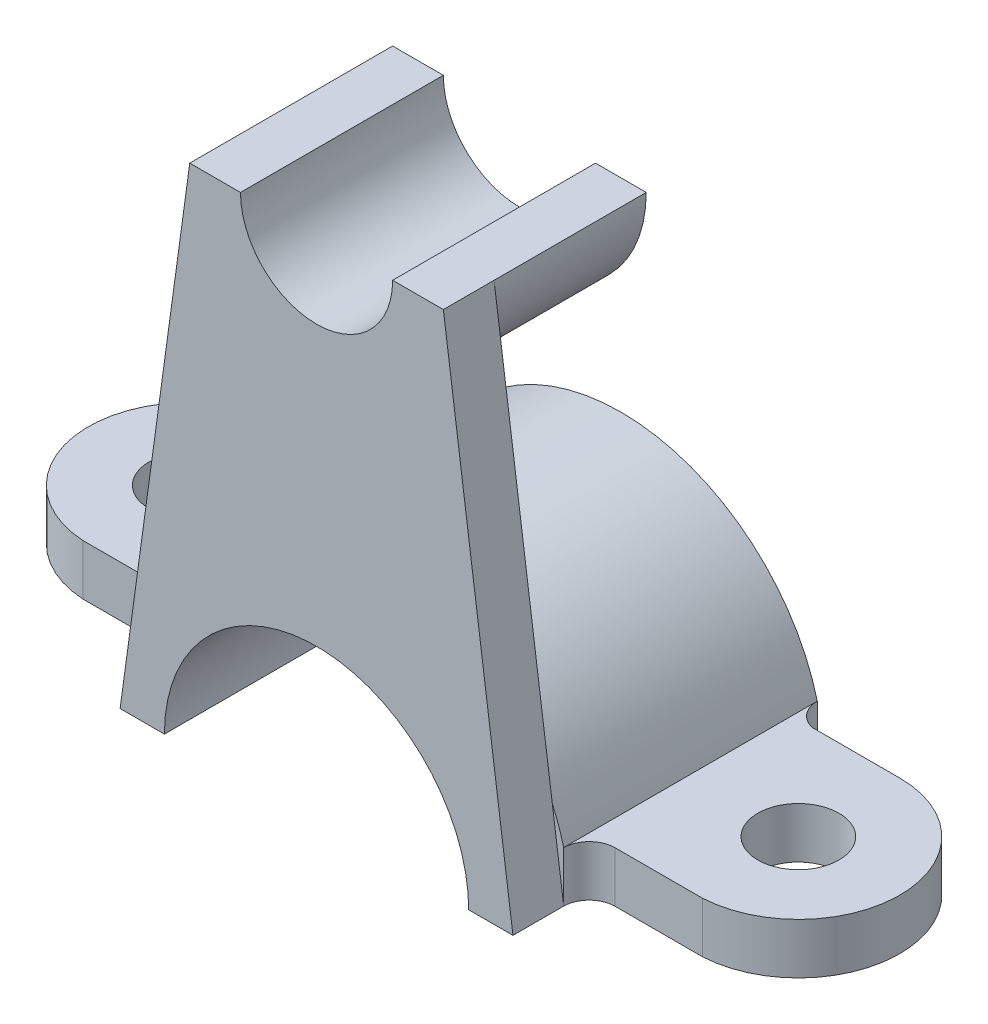
ISO-10303-21;
HEADER;
FILE_DESCRIPTION(('STEP AP214'),'2;1');
FILE_NAME('part.step','',(''),(''),'','','');
FILE_SCHEMA(('AUTOMOTIVE_DESIGN { 1 0 10303 214 1 1 1 1 }'));
ENDSEC;
DATA;
#1=APPLICATION_CONTEXT('core data for automotive mechanical design processes');
#2=APPLICATION_PROTOCOL_DEFINITION('international standard','automotive_design',2000,#1);
#3=PRODUCT_CONTEXT('',#1,'mechanical');
#4=PRODUCT('Part','Part','',(#3));
#5=PRODUCT_RELATED_PRODUCT_CATEGORY('part','',(#4));
#6=PRODUCT_DEFINITION_FORMATION('','',#4);
#7=PRODUCT_DEFINITION_CONTEXT('part definition',#1,'design');
#8=PRODUCT_DEFINITION('design','',#6,#7);
#9=PRODUCT_DEFINITION_SHAPE('','',#8);
#10=(LENGTH_UNIT() NAMED_UNIT(*) SI_UNIT(.MILLI.,.METRE.));
#11=(NAMED_UNIT(*) PLANE_ANGLE_UNIT() SI_UNIT($,.RADIAN.));
#12=(NAMED_UNIT(*) SI_UNIT($,.STERADIAN.) SOLID_ANGLE_UNIT());
#13=UNCERTAINTY_MEASURE_WITH_UNIT(LENGTH_MEASURE(1.E-05),#10,'distance_accuracy_value','');
#14=(GEOMETRIC_REPRESENTATION_CONTEXT(3) GLOBAL_UNCERTAINTY_ASSIGNED_CONTEXT((#13)) GLOBAL_UNIT_ASSIGNED_CONTEXT((#10,
#11,#12)) REPRESENTATION_CONTEXT('',''));
#15=CARTESIAN_POINT('',(0.,0.,0.));
#16=DIRECTION('',(0.,0.,1.));
#17=DIRECTION('',(1.,0.,0.));
#18=AXIS2_PLACEMENT_3D('',#15,#16,#17);
#19=CARTESIAN_POINT('',(-25.,100.,35.));
#20=DIRECTION('',(0.,-1.,0.));
#21=DIRECTION('',(0.,0.,-1.));
#22=AXIS2_PLACEMENT_3D('',#19,#20,#21);
#23=PLANE('',#22);
#24=DIRECTION('',(-1.,0.,0.));
#25=VECTOR('',#24,1.);
#26=CARTESIAN_POINT('',(-25.,100.,35.));
#27=LINE('',#26,#25);
#28=CARTESIAN_POINT('',(-15.,100.,35.));
#29=VERTEX_POINT('',#28);
#30=CARTESIAN_POINT('',(-25.,100.,35.));
#31=VERTEX_POINT('',#30);
#32=EDGE_CURVE('E188',#29,#31,#27,.T.);
#33=ORIENTED_EDGE('',*,*,#32,.F.);
#34=DIRECTION('',(0.,0.,-1.));
#35=VECTOR('',#34,1.);
#36=CARTESIAN_POINT('',(-15.,100.,35.));
#37=LINE('',#36,#35);
#38=CARTESIAN_POINT('',(-15.,100.,-5.));
#39=VERTEX_POINT('',#38);
#40=EDGE_CURVE('E175',#29,#39,#37,.T.);
#41=ORIENTED_EDGE('',*,*,#40,.T.);
#42=DIRECTION('',(1.,0.,0.));
#43=VECTOR('',#42,1.);
#44=CARTESIAN_POINT('',(25.,100.,-5.));
#45=LINE('',#44,#43);
#46=CARTESIAN_POINT('',(-25.,100.,-5.));
#47=VERTEX_POINT('',#46);
#48=EDGE_CURVE('E428',#47,#39,#45,.T.);
#49=ORIENTED_EDGE('',*,*,#48,.F.);
#50=DIRECTION('',(0.,0.,1.));
#51=VECTOR('',#50,1.);
#52=CARTESIAN_POINT('',(-25.,100.,-5.));
#53=LINE('',#52,#51);
#54=CARTESIAN_POINT('',(-25.,100.,25.));
#55=VERTEX_POINT('',#54);
#56=EDGE_CURVE('E357',#47,#55,#53,.T.);
#57=ORIENTED_EDGE('',*,*,#56,.T.);
#58=DIRECTION('',(0.,0.,-1.));
#59=VECTOR('',#58,1.);
#60=CARTESIAN_POINT('',(-25.,100.,35.));
#61=LINE('',#60,#59);
#62=EDGE_CURVE('E195',#31,#55,#61,.T.);
#63=ORIENTED_EDGE('',*,*,#62,.F.);
#64=EDGE_LOOP('',(#33,#41,#49,#57,#63));
#65=FACE_BOUND('',#64,.T.);
#66=ADVANCED_FACE('F32',(#65),#23,.F.);
#67=CARTESIAN_POINT('',(0.,0.,25.));
#68=DIRECTION('',(0.,0.,-1.));
#69=DIRECTION('',(-1.,0.,0.));
#70=AXIS2_PLACEMENT_3D('',#67,#68,#69);
#71=PLANE('',#70);
#72=DIRECTION('',(-0.136022253963476,-0.990705781968944,0.));
#73=VECTOR('',#72,1.);
#74=CARTESIAN_POINT('',(-38.7298334620742,0.,25.));
#75=LINE('',#74,#73);
#76=CARTESIAN_POINT('',(-36.4758209248233,16.4168964137629,25.));
#77=VERTEX_POINT('',#76);
#78=EDGE_CURVE('E43',#55,#77,#75,.T.);
#79=ORIENTED_EDGE('',*,*,#78,.F.);
#80=CARTESIAN_POINT('',(0.,100.,25.));
#81=DIRECTION('',(0.,0.,-1.));
#82=DIRECTION('',(-1.,0.,0.));
#83=AXIS2_PLACEMENT_3D('',#80,#81,#82);
#84=CIRCLE('',#83,25.);
#85=CARTESIAN_POINT('',(25.,100.,25.));
#86=VERTEX_POINT('',#85);
#87=EDGE_CURVE('E420',#86,#55,#84,.T.);
#88=ORIENTED_EDGE('',*,*,#87,.F.);
#89=DIRECTION('',(-0.136022253963476,0.990705781968944,0.));
#90=VECTOR('',#89,1.);
#91=CARTESIAN_POINT('',(38.7298334620742,0.,25.));
#92=LINE('',#91,#90);
#93=CARTESIAN_POINT('',(36.4758209248233,16.4168964137629,25.));
#94=VERTEX_POINT('',#93);
#95=EDGE_CURVE('E204',#94,#86,#92,.T.);
#96=ORIENTED_EDGE('',*,*,#95,.F.);
#97=CARTESIAN_POINT('',(0.,0.,25.));
#98=DIRECTION('',(0.,0.,1.));
#99=DIRECTION('',(1.,0.,0.));
#100=AXIS2_PLACEMENT_3D('',#97,#98,#99);
#101=CIRCLE('',#100,40.);
#102=EDGE_CURVE('E318',#94,#77,#101,.T.);
#103=ORIENTED_EDGE('',*,*,#102,.T.);
#104=EDGE_LOOP('',(#79,#88,#96,#103));
#105=FACE_BOUND('',#104,.T.);
#106=ADVANCED_FACE('F380',(#105),#71,.T.);
#107=CARTESIAN_POINT('',(-30.,0.,25.));
#108=DIRECTION('',(0.,1.,0.));
#109=DIRECTION('',(-1.,0.,0.));
#110=AXIS2_PLACEMENT_3D('',#107,#108,#109);
#111=PLANE('',#110);
#112=CARTESIAN_POINT('',(60.,0.,0.));
#113=DIRECTION('',(0.,-1.,0.));
#114=DIRECTION('',(1.,0.,0.));
#115=AXIS2_PLACEMENT_3D('',#112,#113,#114);
#116=CIRCLE('',#115,8.);
#117=CARTESIAN_POINT('',(68.,0.,0.));
#118=VERTEX_POINT('',#117);
#119=EDGE_CURVE('E260',#118,#118,#116,.T.);
#120=ORIENTED_EDGE('',*,*,#119,.F.);
#121=EDGE_LOOP('',(#120));
#122=FACE_BOUND('',#121,.T.);
#123=DIRECTION('',(1.,0.,0.));
#124=VECTOR('',#123,1.);
#125=CARTESIAN_POINT('',(38.7298334620742,0.,35.));
#126=LINE('',#125,#124);
#127=CARTESIAN_POINT('',(30.,0.,35.));
#128=VERTEX_POINT('',#127);
#129=CARTESIAN_POINT('',(38.7298334620742,0.,35.));
#130=VERTEX_POINT('',#129);
#131=EDGE_CURVE('E356',#128,#130,#126,.T.);
#132=ORIENTED_EDGE('',*,*,#131,.F.);
#133=DIRECTION('',(0.,0.,-1.));
#134=VECTOR('',#133,1.);
#135=CARTESIAN_POINT('',(30.,0.,25.));
#136=LINE('',#135,#134);
#137=CARTESIAN_POINT('',(30.,0.,-25.));
#138=VERTEX_POINT('',#137);
#139=EDGE_CURVE('E41',#128,#138,#136,.T.);
#140=ORIENTED_EDGE('',*,*,#139,.T.);
#141=DIRECTION('',(1.,0.,0.));
#142=VECTOR('',#141,1.);
#143=CARTESIAN_POINT('',(30.,0.,-25.));
#144=LINE('',#143,#142);
#145=CARTESIAN_POINT('',(38.7298334620742,0.,-25.));
#146=VERTEX_POINT('',#145);
#147=EDGE_CURVE('E322',#138,#146,#144,.T.);
#148=ORIENTED_EDGE('',*,*,#147,.T.);
#149=CARTESIAN_POINT('',(43.8465520147104,0.,-25.));
#150=DIRECTION('',(0.,-1.,0.));
#151=DIRECTION('',(-1.,0.,0.));
#152=AXIS2_PLACEMENT_3D('',#149,#150,#151);
#153=CIRCLE('',#152,5.11671855263618);
#154=CARTESIAN_POINT('',(42.7599017734224,0.,-20.));
#155=VERTEX_POINT('',#154);
#156=EDGE_CURVE('E228',#155,#146,#153,.T.);
#157=ORIENTED_EDGE('',*,*,#156,.F.);
#158=DIRECTION('',(-1.,0.,0.));
#159=VECTOR('',#158,1.);
#160=CARTESIAN_POINT('',(42.7599017734224,0.,-20.));
#161=LINE('',#160,#159);
#162=CARTESIAN_POINT('',(60.,0.,-20.));
#163=VERTEX_POINT('',#162);
#164=EDGE_CURVE('E230',#163,#155,#161,.T.);
#165=ORIENTED_EDGE('',*,*,#164,.F.);
#166=CARTESIAN_POINT('',(60.,0.,0.));
#167=DIRECTION('',(0.,1.,0.));
#168=DIRECTION('',(1.,0.,0.));
#169=AXIS2_PLACEMENT_3D('',#166,#167,#168);
#170=CIRCLE('',#169,20.);
#171=CARTESIAN_POINT('',(61.0859068596522,0.,19.970498398692));
#172=VERTEX_POINT('',#171);
#173=EDGE_CURVE('E221',#172,#163,#170,.T.);
#174=ORIENTED_EDGE('',*,*,#173,.F.);
#175=DIRECTION('',(1.,0.,0.));
#176=VECTOR('',#175,1.);
#177=CARTESIAN_POINT('',(61.0859068596522,0.,19.970498398692));
#178=LINE('',#177,#176);
#179=CARTESIAN_POINT('',(43.8458086330746,0.,19.970498398692));
#180=VERTEX_POINT('',#179);
#181=EDGE_CURVE('E223',#180,#172,#178,.T.);
#182=ORIENTED_EDGE('',*,*,#181,.F.);
#183=CARTESIAN_POINT('',(43.8458086330746,0.,25.0872169513282));
#184=DIRECTION('',(0.,-1.,0.));
#185=DIRECTION('',(-1.,0.,0.));
#186=AXIS2_PLACEMENT_3D('',#183,#184,#185);
#187=CIRCLE('',#186,5.11671855263618);
#188=CARTESIAN_POINT('',(38.7298334620742,0.,25.));
#189=VERTEX_POINT('',#188);
#190=EDGE_CURVE('E226',#189,#180,#187,.T.);
#191=ORIENTED_EDGE('',*,*,#190,.F.);
#192=DIRECTION('',(0.,0.,-1.));
#193=VECTOR('',#192,1.);
#194=CARTESIAN_POINT('',(38.7298334620742,0.,35.));
#195=LINE('',#194,#193);
#196=EDGE_CURVE('E214',#130,#189,#195,.T.);
#197=ORIENTED_EDGE('',*,*,#196,.F.);
#198=EDGE_LOOP('',(#132,#140,#148,#157,#165,#174,#182,#191,#197));
#199=FACE_BOUND('',#198,.T.);
#200=ADVANCED_FACE('F354',(#122,#199),#111,.F.);
#201=CARTESIAN_POINT('',(0.,0.,25.));
#202=DIRECTION('',(0.,0.,1.));
#203=DIRECTION('',(1.,0.,0.));
#204=AXIS2_PLACEMENT_3D('',#201,#202,#203);
#205=PLANE('',#204);
#206=CARTESIAN_POINT('',(-38.7298334620742,0.,25.));
#207=VERTEX_POINT('',#206);
#208=EDGE_CURVE('E11',#77,#207,#75,.T.);
#209=ORIENTED_EDGE('',*,*,#208,.F.);
#210=CARTESIAN_POINT('',(-38.7298334620742,9.99999999999998,25.));
#211=VERTEX_POINT('',#210);
#212=EDGE_CURVE('E319',#77,#211,#101,.T.);
#213=ORIENTED_EDGE('',*,*,#212,.T.);
#214=DIRECTION('',(0.,1.,0.));
#215=VECTOR('',#214,1.);
#216=CARTESIAN_POINT('',(-38.7298334620742,0.,25.));
#217=LINE('',#216,#215);
#218=EDGE_CURVE('E300',#207,#211,#217,.T.);
#219=ORIENTED_EDGE('',*,*,#218,.F.);
#220=EDGE_LOOP('',(#209,#213,#219));
#221=FACE_BOUND('',#220,.T.);
#222=ADVANCED_FACE('F372',(#221),#205,.T.);
#223=CARTESIAN_POINT('',(90.,10.,25.));
#224=DIRECTION('',(0.,-1.,0.));
#225=DIRECTION('',(0.,0.,-1.));
#226=AXIS2_PLACEMENT_3D('',#223,#224,#225);
#227=PLANE('',#226);
#228=CARTESIAN_POINT('',(60.,9.99999999999999,0.));
#229=DIRECTION('',(0.,-1.,0.));
#230=DIRECTION('',(1.,0.,0.));
#231=AXIS2_PLACEMENT_3D('',#228,#229,#230);
#232=CIRCLE('',#231,8.);
#233=CARTESIAN_POINT('',(68.,9.99999999999999,0.));
#234=VERTEX_POINT('',#233);
#235=EDGE_CURVE('E249',#234,#234,#232,.T.);
#236=ORIENTED_EDGE('',*,*,#235,.T.);
#237=EDGE_LOOP('',(#236));
#238=FACE_BOUND('',#237,.T.);
#239=CARTESIAN_POINT('',(43.8465520147104,9.99999999999998,-25.));
#240=DIRECTION('',(0.,-1.,0.));
#241=DIRECTION('',(-1.,0.,0.));
#242=AXIS2_PLACEMENT_3D('',#239,#240,#241);
#243=CIRCLE('',#242,5.11671855263618);
#244=CARTESIAN_POINT('',(42.7599017734224,9.99999999999998,-20.));
#245=VERTEX_POINT('',#244);
#246=CARTESIAN_POINT('',(38.7298334620742,9.99999999999998,-25.));
#247=VERTEX_POINT('',#246);
#248=EDGE_CURVE('E241',#245,#247,#243,.T.);
#249=ORIENTED_EDGE('',*,*,#248,.T.);
#250=DIRECTION('',(0.,0.,-1.));
#251=VECTOR('',#250,1.);
#252=CARTESIAN_POINT('',(38.7298334620742,10.,25.));
#253=LINE('',#252,#251);
#254=CARTESIAN_POINT('',(38.7298334620742,9.99999999999998,25.));
#255=VERTEX_POINT('',#254);
#256=EDGE_CURVE('E333',#255,#247,#253,.T.);
#257=ORIENTED_EDGE('',*,*,#256,.F.);
#258=CARTESIAN_POINT('',(43.8458086330746,9.99999999999998,25.0872169513282));
#259=DIRECTION('',(0.,-1.,0.));
#260=DIRECTION('',(-1.,0.,0.));
#261=AXIS2_PLACEMENT_3D('',#258,#259,#260);
#262=CIRCLE('',#261,5.11671855263618);
#263=CARTESIAN_POINT('',(43.8458086330746,9.99999999999998,19.970498398692));
#264=VERTEX_POINT('',#263);
#265=EDGE_CURVE('E238',#255,#264,#262,.T.);
#266=ORIENTED_EDGE('',*,*,#265,.T.);
#267=DIRECTION('',(1.,0.,0.));
#268=VECTOR('',#267,1.);
#269=CARTESIAN_POINT('',(61.0859068596522,9.99999999999999,19.970498398692));
#270=LINE('',#269,#268);
#271=CARTESIAN_POINT('',(61.0859068596522,9.99999999999999,19.970498398692));
#272=VERTEX_POINT('',#271);
#273=EDGE_CURVE('E235',#264,#272,#270,.T.);
#274=ORIENTED_EDGE('',*,*,#273,.T.);
#275=CARTESIAN_POINT('',(60.,9.99999999999999,0.));
#276=DIRECTION('',(0.,1.,0.));
#277=DIRECTION('',(1.,0.,0.));
#278=AXIS2_PLACEMENT_3D('',#275,#276,#277);
#279=CIRCLE('',#278,20.);
#280=CARTESIAN_POINT('',(60.,9.99999999999999,-20.));
#281=VERTEX_POINT('',#280);
#282=EDGE_CURVE('E220',#272,#281,#279,.T.);
#283=ORIENTED_EDGE('',*,*,#282,.T.);
#284=DIRECTION('',(-1.,0.,0.));
#285=VECTOR('',#284,1.);
#286=CARTESIAN_POINT('',(42.7599017734224,9.99999999999998,-20.));
#287=LINE('',#286,#285);
#288=EDGE_CURVE('E224',#281,#245,#287,.T.);
#289=ORIENTED_EDGE('',*,*,#288,.T.);
#290=EDGE_LOOP('',(#249,#257,#266,#274,#283,#289));
#291=FACE_BOUND('',#290,.T.);
#292=ADVANCED_FACE('F392',(#238,#291),#227,.F.);
#293=EDGE_CURVE('E206',#189,#94,#92,.T.);
#294=ORIENTED_EDGE('',*,*,#293,.F.);
#295=DIRECTION('',(0.,1.,0.));
#296=VECTOR('',#295,1.);
#297=CARTESIAN_POINT('',(38.7298334620742,0.,25.));
#298=LINE('',#297,#296);
#299=EDGE_CURVE('E254',#189,#255,#298,.T.);
#300=ORIENTED_EDGE('',*,*,#299,.T.);
#301=EDGE_CURVE('E315',#255,#94,#101,.T.);
#302=ORIENTED_EDGE('',*,*,#301,.T.);
#303=EDGE_LOOP('',(#294,#300,#302));
#304=FACE_BOUND('',#303,.T.);
#305=ADVANCED_FACE('F387',(#304),#205,.T.);
#306=CARTESIAN_POINT('',(0.,0.,-25.));
#307=DIRECTION('',(0.,0.,1.));
#308=DIRECTION('',(1.,0.,0.));
#309=AXIS2_PLACEMENT_3D('',#306,#307,#308);
#310=PLANE('',#309);
#311=DIRECTION('',(0.,1.,0.));
#312=VECTOR('',#311,1.);
#313=CARTESIAN_POINT('',(38.7298334620742,0.,-25.));
#314=LINE('',#313,#312);
#315=EDGE_CURVE('E252',#146,#247,#314,.T.);
#316=ORIENTED_EDGE('',*,*,#315,.F.);
#317=ORIENTED_EDGE('',*,*,#147,.F.);
#318=CARTESIAN_POINT('',(0.,0.,-25.));
#319=DIRECTION('',(0.,0.,-1.));
#320=DIRECTION('',(1.,0.,0.));
#321=AXIS2_PLACEMENT_3D('',#318,#319,#320);
#322=CIRCLE('',#321,30.);
#323=CARTESIAN_POINT('',(-30.,0.,-25.));
#324=VERTEX_POINT('',#323);
#325=EDGE_CURVE('E312',#324,#138,#322,.T.);
#326=ORIENTED_EDGE('',*,*,#325,.F.);
#327=DIRECTION('',(1.,0.,0.));
#328=VECTOR('',#327,1.);
#329=CARTESIAN_POINT('',(-30.,0.,-25.));
#330=LINE('',#329,#328);
#331=CARTESIAN_POINT('',(-38.7298334620742,0.,-25.));
#332=VERTEX_POINT('',#331);
#333=EDGE_CURVE('E328',#332,#324,#330,.T.);
#334=ORIENTED_EDGE('',*,*,#333,.F.);
#335=DIRECTION('',(0.,1.,0.));
#336=VECTOR('',#335,1.);
#337=CARTESIAN_POINT('',(-38.7298334620742,0.,-25.));
#338=LINE('',#337,#336);
#339=CARTESIAN_POINT('',(-38.7298334620742,9.99999999999998,-25.));
#340=VERTEX_POINT('',#339);
#341=EDGE_CURVE('E303',#332,#340,#338,.T.);
#342=ORIENTED_EDGE('',*,*,#341,.T.);
#343=CARTESIAN_POINT('',(0.,0.,-25.));
#344=DIRECTION('',(0.,0.,1.));
#345=DIRECTION('',(1.,0.,0.));
#346=AXIS2_PLACEMENT_3D('',#343,#344,#345);
#347=CIRCLE('',#346,40.);
#348=EDGE_CURVE('E325',#247,#340,#347,.T.);
#349=ORIENTED_EDGE('',*,*,#348,.F.);
#350=EDGE_LOOP('',(#316,#317,#326,#334,#342,#349));
#351=FACE_BOUND('',#350,.T.);
#352=ADVANCED_FACE('F349',(#351),#310,.F.);
#353=CARTESIAN_POINT('',(0.,0.,25.));
#354=DIRECTION('',(0.,0.,-1.));
#355=DIRECTION('',(-1.,0.,0.));
#356=AXIS2_PLACEMENT_3D('',#353,#354,#355);
#357=CYLINDRICAL_SURFACE('',#356,30.);
#358=ORIENTED_EDGE('',*,*,#325,.T.);
#359=ORIENTED_EDGE('',*,*,#139,.F.);
#360=CARTESIAN_POINT('',(0.,0.,35.));
#361=DIRECTION('',(0.,0.,-1.));
#362=DIRECTION('',(-1.,0.,0.));
#363=AXIS2_PLACEMENT_3D('',#360,#361,#362);
#364=CIRCLE('',#363,30.);
#365=CARTESIAN_POINT('',(-30.,0.,35.));
#366=VERTEX_POINT('',#365);
#367=EDGE_CURVE('E205',#366,#128,#364,.T.);
#368=ORIENTED_EDGE('',*,*,#367,.F.);
#369=DIRECTION('',(0.,0.,-1.));
#370=VECTOR('',#369,1.);
#371=CARTESIAN_POINT('',(-30.,0.,25.));
#372=LINE('',#371,#370);
#373=EDGE_CURVE('E317',#366,#324,#372,.T.);
#374=ORIENTED_EDGE('',*,*,#373,.T.);
#375=EDGE_LOOP('',(#358,#359,#368,#374));
#376=FACE_BOUND('',#375,.T.);
#377=ADVANCED_FACE('F34',(#376),#357,.F.);
#378=CARTESIAN_POINT('',(0.,0.,25.));
#379=DIRECTION('',(0.,0.,-1.));
#380=DIRECTION('',(-1.,0.,0.));
#381=AXIS2_PLACEMENT_3D('',#378,#379,#380);
#382=CYLINDRICAL_SURFACE('',#381,40.);
#383=ORIENTED_EDGE('',*,*,#348,.T.);
#384=DIRECTION('',(0.,0.,-1.));
#385=VECTOR('',#384,1.);
#386=CARTESIAN_POINT('',(-38.7298334620742,9.99999999999998,25.));
#387=LINE('',#386,#385);
#388=EDGE_CURVE('E330',#211,#340,#387,.T.);
#389=ORIENTED_EDGE('',*,*,#388,.F.);
#390=ORIENTED_EDGE('',*,*,#212,.F.);
#391=ORIENTED_EDGE('',*,*,#102,.F.);
#392=ORIENTED_EDGE('',*,*,#301,.F.);
#393=ORIENTED_EDGE('',*,*,#256,.T.);
#394=EDGE_LOOP('',(#383,#389,#390,#391,#392,#393));
#395=FACE_BOUND('',#394,.T.);
#396=ADVANCED_FACE('F384',(#395),#382,.T.);
#397=CARTESIAN_POINT('',(-90.,10.,25.));
#398=DIRECTION('',(0.,-1.,0.));
#399=DIRECTION('',(1.,0.,0.));
#400=AXIS2_PLACEMENT_3D('',#397,#398,#399);
#401=PLANE('',#400);
#402=CARTESIAN_POINT('',(-60.,9.99999999999999,0.));
#403=DIRECTION('',(0.,1.,0.));
#404=DIRECTION('',(-1.,0.,0.));
#405=AXIS2_PLACEMENT_3D('',#402,#403,#404);
#406=CIRCLE('',#405,8.);
#407=CARTESIAN_POINT('',(-68.,9.99999999999999,0.));
#408=VERTEX_POINT('',#407);
#409=EDGE_CURVE('E297',#408,#408,#406,.T.);
#410=ORIENTED_EDGE('',*,*,#409,.F.);
#411=EDGE_LOOP('',(#410));
#412=FACE_BOUND('',#411,.T.);
#413=DIRECTION('',(-1.,0.,0.));
#414=VECTOR('',#413,1.);
#415=CARTESIAN_POINT('',(-61.0859068596522,9.99999999999999,19.970498398692));
#416=LINE('',#415,#414);
#417=CARTESIAN_POINT('',(-43.8458086330746,9.99999999999998,19.970498398692));
#418=VERTEX_POINT('',#417);
#419=CARTESIAN_POINT('',(-61.0859068596522,9.99999999999999,19.970498398692));
#420=VERTEX_POINT('',#419);
#421=EDGE_CURVE('E270',#418,#420,#416,.T.);
#422=ORIENTED_EDGE('',*,*,#421,.F.);
#423=CARTESIAN_POINT('',(-43.8458086330746,9.99999999999998,25.0872169513282));
#424=DIRECTION('',(0.,1.,0.));
#425=DIRECTION('',(1.,0.,0.));
#426=AXIS2_PLACEMENT_3D('',#423,#424,#425);
#427=CIRCLE('',#426,5.11671855263618);
#428=EDGE_CURVE('E290',#211,#418,#427,.T.);
#429=ORIENTED_EDGE('',*,*,#428,.F.);
#430=ORIENTED_EDGE('',*,*,#388,.T.);
#431=CARTESIAN_POINT('',(-43.8465520147104,9.99999999999998,-25.));
#432=DIRECTION('',(0.,1.,0.));
#433=DIRECTION('',(1.,0.,0.));
#434=AXIS2_PLACEMENT_3D('',#431,#432,#433);
#435=CIRCLE('',#434,5.11671855263618);
#436=CARTESIAN_POINT('',(-42.7599017734224,9.99999999999998,-20.));
#437=VERTEX_POINT('',#436);
#438=EDGE_CURVE('E288',#437,#340,#435,.T.);
#439=ORIENTED_EDGE('',*,*,#438,.F.);
#440=DIRECTION('',(1.,0.,0.));
#441=VECTOR('',#440,1.);
#442=CARTESIAN_POINT('',(-42.7599017734224,9.99999999999998,-20.));
#443=LINE('',#442,#441);
#444=CARTESIAN_POINT('',(-60.,9.99999999999999,-20.));
#445=VERTEX_POINT('',#444);
#446=EDGE_CURVE('E285',#445,#437,#443,.T.);
#447=ORIENTED_EDGE('',*,*,#446,.F.);
#448=CARTESIAN_POINT('',(-60.,9.99999999999999,0.));
#449=DIRECTION('',(0.,-1.,0.));
#450=DIRECTION('',(-1.,0.,0.));
#451=AXIS2_PLACEMENT_3D('',#448,#449,#450);
#452=CIRCLE('',#451,20.);
#453=EDGE_CURVE('E263',#420,#445,#452,.T.);
#454=ORIENTED_EDGE('',*,*,#453,.F.);
#455=EDGE_LOOP('',(#422,#429,#430,#439,#447,#454));
#456=FACE_BOUND('',#455,.T.);
#457=ADVANCED_FACE('F504',(#412,#456),#401,.F.);
#458=ORIENTED_EDGE('',*,*,#373,.F.);
#459=CARTESIAN_POINT('',(-38.7298334620742,0.,35.));
#460=VERTEX_POINT('',#459);
#461=EDGE_CURVE('E199',#460,#366,#126,.T.);
#462=ORIENTED_EDGE('',*,*,#461,.F.);
#463=DIRECTION('',(0.,0.,-1.));
#464=VECTOR('',#463,1.);
#465=CARTESIAN_POINT('',(-38.7298334620742,0.,35.));
#466=LINE('',#465,#464);
#467=EDGE_CURVE('E217',#460,#207,#466,.T.);
#468=ORIENTED_EDGE('',*,*,#467,.T.);
#469=CARTESIAN_POINT('',(-43.8458086330746,0.,25.0872169513282));
#470=DIRECTION('',(0.,1.,0.));
#471=DIRECTION('',(1.,0.,0.));
#472=AXIS2_PLACEMENT_3D('',#469,#470,#471);
#473=CIRCLE('',#472,5.11671855263618);
#474=CARTESIAN_POINT('',(-43.8458086330746,0.,19.970498398692));
#475=VERTEX_POINT('',#474);
#476=EDGE_CURVE('E276',#207,#475,#473,.T.);
#477=ORIENTED_EDGE('',*,*,#476,.T.);
#478=DIRECTION('',(-1.,0.,0.));
#479=VECTOR('',#478,1.);
#480=CARTESIAN_POINT('',(-61.0859068596522,0.,19.970498398692));
#481=LINE('',#480,#479);
#482=CARTESIAN_POINT('',(-61.0859068596522,0.,19.970498398692));
#483=VERTEX_POINT('',#482);
#484=EDGE_CURVE('E279',#475,#483,#481,.T.);
#485=ORIENTED_EDGE('',*,*,#484,.T.);
#486=CARTESIAN_POINT('',(-60.,0.,0.));
#487=DIRECTION('',(0.,-1.,0.));
#488=DIRECTION('',(-1.,0.,0.));
#489=AXIS2_PLACEMENT_3D('',#486,#487,#488);
#490=CIRCLE('',#489,20.);
#491=CARTESIAN_POINT('',(-60.,0.,-20.));
#492=VERTEX_POINT('',#491);
#493=EDGE_CURVE('E266',#483,#492,#490,.T.);
#494=ORIENTED_EDGE('',*,*,#493,.T.);
#495=DIRECTION('',(1.,0.,0.));
#496=VECTOR('',#495,1.);
#497=CARTESIAN_POINT('',(-42.7599017734224,0.,-20.));
#498=LINE('',#497,#496);
#499=CARTESIAN_POINT('',(-42.7599017734224,0.,-20.));
#500=VERTEX_POINT('',#499);
#501=EDGE_CURVE('E269',#492,#500,#498,.T.);
#502=ORIENTED_EDGE('',*,*,#501,.T.);
#503=CARTESIAN_POINT('',(-43.8465520147104,0.,-25.));
#504=DIRECTION('',(0.,1.,0.));
#505=DIRECTION('',(1.,0.,0.));
#506=AXIS2_PLACEMENT_3D('',#503,#504,#505);
#507=CIRCLE('',#506,5.11671855263618);
#508=EDGE_CURVE('E273',#500,#332,#507,.T.);
#509=ORIENTED_EDGE('',*,*,#508,.T.);
#510=ORIENTED_EDGE('',*,*,#333,.T.);
#511=EDGE_LOOP('',(#458,#462,#468,#477,#485,#494,#502,#509,#510));
#512=FACE_BOUND('',#511,.T.);
#513=CARTESIAN_POINT('',(-60.,0.,0.));
#514=DIRECTION('',(0.,1.,0.));
#515=DIRECTION('',(-1.,0.,0.));
#516=AXIS2_PLACEMENT_3D('',#513,#514,#515);
#517=CIRCLE('',#516,8.);
#518=CARTESIAN_POINT('',(-68.,0.,0.));
#519=VERTEX_POINT('',#518);
#520=EDGE_CURVE('E309',#519,#519,#517,.T.);
#521=ORIENTED_EDGE('',*,*,#520,.T.);
#522=EDGE_LOOP('',(#521));
#523=FACE_BOUND('',#522,.T.);
#524=ADVANCED_FACE('F366',(#512,#523),#111,.F.);
#525=CARTESIAN_POINT('',(-60.,0.,0.));
#526=DIRECTION('',(0.,1.,0.));
#527=DIRECTION('',(-1.,0.,0.));
#528=AXIS2_PLACEMENT_3D('',#525,#526,#527);
#529=CYLINDRICAL_SURFACE('',#528,8.);
#530=ORIENTED_EDGE('',*,*,#520,.F.);
#531=EDGE_LOOP('',(#530));
#532=FACE_BOUND('',#531,.T.);
#533=ORIENTED_EDGE('',*,*,#409,.T.);
#534=EDGE_LOOP('',(#533));
#535=FACE_BOUND('',#534,.T.);
#536=ADVANCED_FACE('F493',(#532,#535),#529,.F.);
#537=CARTESIAN_POINT('',(-60.,0.,0.));
#538=DIRECTION('',(0.,1.,0.));
#539=DIRECTION('',(-1.,0.,0.));
#540=AXIS2_PLACEMENT_3D('',#537,#538,#539);
#541=CYLINDRICAL_SURFACE('',#540,20.);
#542=ORIENTED_EDGE('',*,*,#453,.T.);
#543=DIRECTION('',(0.,1.,0.));
#544=VECTOR('',#543,1.);
#545=CARTESIAN_POINT('',(-60.,0.,-20.));
#546=LINE('',#545,#544);
#547=EDGE_CURVE('E282',#492,#445,#546,.T.);
#548=ORIENTED_EDGE('',*,*,#547,.F.);
#549=ORIENTED_EDGE('',*,*,#493,.F.);
#550=DIRECTION('',(0.,1.,0.));
#551=VECTOR('',#550,1.);
#552=CARTESIAN_POINT('',(-61.0859068596522,0.,19.970498398692));
#553=LINE('',#552,#551);
#554=EDGE_CURVE('E295',#483,#420,#553,.T.);
#555=ORIENTED_EDGE('',*,*,#554,.T.);
#556=EDGE_LOOP('',(#542,#548,#549,#555));
#557=FACE_BOUND('',#556,.T.);
#558=ADVANCED_FACE('F480',(#557),#541,.T.);
#559=CARTESIAN_POINT('',(-61.0859068596522,0.,19.970498398692));
#560=DIRECTION('',(0.,0.,-1.));
#561=DIRECTION('',(-1.,0.,0.));
#562=AXIS2_PLACEMENT_3D('',#559,#560,#561);
#563=PLANE('',#562);
#564=ORIENTED_EDGE('',*,*,#421,.T.);
#565=ORIENTED_EDGE('',*,*,#554,.F.);
#566=ORIENTED_EDGE('',*,*,#484,.F.);
#567=DIRECTION('',(0.,1.,0.));
#568=VECTOR('',#567,1.);
#569=CARTESIAN_POINT('',(-43.8458086330746,0.,19.970498398692));
#570=LINE('',#569,#568);
#571=EDGE_CURVE('E298',#475,#418,#570,.T.);
#572=ORIENTED_EDGE('',*,*,#571,.T.);
#573=EDGE_LOOP('',(#564,#565,#566,#572));
#574=FACE_BOUND('',#573,.T.);
#575=ADVANCED_FACE('F477',(#574),#563,.F.);
#576=CARTESIAN_POINT('',(-43.8458086330746,0.,25.0872169513282));
#577=DIRECTION('',(0.,1.,0.));
#578=DIRECTION('',(-1.,0.,0.));
#579=AXIS2_PLACEMENT_3D('',#576,#577,#578);
#580=CYLINDRICAL_SURFACE('',#579,5.11671855263618);
#581=ORIENTED_EDGE('',*,*,#428,.T.);
#582=ORIENTED_EDGE('',*,*,#571,.F.);
#583=ORIENTED_EDGE('',*,*,#476,.F.);
#584=ORIENTED_EDGE('',*,*,#218,.T.);
#585=EDGE_LOOP('',(#581,#582,#583,#584));
#586=FACE_BOUND('',#585,.T.);
#587=ADVANCED_FACE('F370',(#586),#580,.F.);
#588=CARTESIAN_POINT('',(-43.8465520147104,0.,-25.));
#589=DIRECTION('',(0.,1.,0.));
#590=DIRECTION('',(-1.,0.,0.));
#591=AXIS2_PLACEMENT_3D('',#588,#589,#590);
#592=CYLINDRICAL_SURFACE('',#591,5.11671855263618);
#593=ORIENTED_EDGE('',*,*,#438,.T.);
#594=ORIENTED_EDGE('',*,*,#341,.F.);
#595=ORIENTED_EDGE('',*,*,#508,.F.);
#596=DIRECTION('',(0.,1.,0.));
#597=VECTOR('',#596,1.);
#598=CARTESIAN_POINT('',(-42.7599017734224,0.,-20.));
#599=LINE('',#598,#597);
#600=EDGE_CURVE('E306',#500,#437,#599,.T.);
#601=ORIENTED_EDGE('',*,*,#600,.T.);
#602=EDGE_LOOP('',(#593,#594,#595,#601));
#603=FACE_BOUND('',#602,.T.);
#604=ADVANCED_FACE('F484',(#603),#592,.F.);
#605=CARTESIAN_POINT('',(-42.7599017734224,0.,-20.));
#606=DIRECTION('',(0.,0.,1.));
#607=DIRECTION('',(1.,0.,0.));
#608=AXIS2_PLACEMENT_3D('',#605,#606,#607);
#609=PLANE('',#608);
#610=ORIENTED_EDGE('',*,*,#446,.T.);
#611=ORIENTED_EDGE('',*,*,#600,.F.);
#612=ORIENTED_EDGE('',*,*,#501,.F.);
#613=ORIENTED_EDGE('',*,*,#547,.T.);
#614=EDGE_LOOP('',(#610,#611,#612,#613));
#615=FACE_BOUND('',#614,.T.);
#616=ADVANCED_FACE('F475',(#615),#609,.F.);
#617=CARTESIAN_POINT('',(60.,0.,0.));
#618=DIRECTION('',(0.,1.,0.));
#619=DIRECTION('',(-1.,0.,0.));
#620=AXIS2_PLACEMENT_3D('',#617,#618,#619);
#621=CYLINDRICAL_SURFACE('',#620,8.);
#622=ORIENTED_EDGE('',*,*,#119,.T.);
#623=EDGE_LOOP('',(#622));
#624=FACE_BOUND('',#623,.T.);
#625=ORIENTED_EDGE('',*,*,#235,.F.);
#626=EDGE_LOOP('',(#625));
#627=FACE_BOUND('',#626,.T.);
#628=ADVANCED_FACE('F472',(#624,#627),#621,.F.);
#629=CARTESIAN_POINT('',(60.,0.,0.));
#630=DIRECTION('',(0.,1.,0.));
#631=DIRECTION('',(-1.,0.,0.));
#632=AXIS2_PLACEMENT_3D('',#629,#630,#631);
#633=CYLINDRICAL_SURFACE('',#632,20.);
#634=ORIENTED_EDGE('',*,*,#282,.F.);
#635=DIRECTION('',(0.,1.,0.));
#636=VECTOR('',#635,1.);
#637=CARTESIAN_POINT('',(61.0859068596522,0.,19.970498398692));
#638=LINE('',#637,#636);
#639=EDGE_CURVE('E232',#172,#272,#638,.T.);
#640=ORIENTED_EDGE('',*,*,#639,.F.);
#641=ORIENTED_EDGE('',*,*,#173,.T.);
#642=DIRECTION('',(0.,1.,0.));
#643=VECTOR('',#642,1.);
#644=CARTESIAN_POINT('',(60.,0.,-20.));
#645=LINE('',#644,#643);
#646=EDGE_CURVE('E246',#163,#281,#645,.T.);
#647=ORIENTED_EDGE('',*,*,#646,.T.);
#648=EDGE_LOOP('',(#634,#640,#641,#647));
#649=FACE_BOUND('',#648,.T.);
#650=ADVANCED_FACE('F405',(#649),#633,.T.);
#651=CARTESIAN_POINT('',(42.7599017734224,0.,-20.));
#652=DIRECTION('',(0.,0.,-1.));
#653=DIRECTION('',(-1.,0.,0.));
#654=AXIS2_PLACEMENT_3D('',#651,#652,#653);
#655=PLANE('',#654);
#656=ORIENTED_EDGE('',*,*,#288,.F.);
#657=ORIENTED_EDGE('',*,*,#646,.F.);
#658=ORIENTED_EDGE('',*,*,#164,.T.);
#659=DIRECTION('',(0.,1.,0.));
#660=VECTOR('',#659,1.);
#661=CARTESIAN_POINT('',(42.7599017734224,0.,-20.));
#662=LINE('',#661,#660);
#663=EDGE_CURVE('E250',#155,#245,#662,.T.);
#664=ORIENTED_EDGE('',*,*,#663,.T.);
#665=EDGE_LOOP('',(#656,#657,#658,#664));
#666=FACE_BOUND('',#665,.T.);
#667=ADVANCED_FACE('F402',(#666),#655,.T.);
#668=CARTESIAN_POINT('',(43.8465520147104,0.,-25.));
#669=DIRECTION('',(0.,1.,0.));
#670=DIRECTION('',(-1.,0.,0.));
#671=AXIS2_PLACEMENT_3D('',#668,#669,#670);
#672=CYLINDRICAL_SURFACE('',#671,5.11671855263618);
#673=ORIENTED_EDGE('',*,*,#248,.F.);
#674=ORIENTED_EDGE('',*,*,#663,.F.);
#675=ORIENTED_EDGE('',*,*,#156,.T.);
#676=ORIENTED_EDGE('',*,*,#315,.T.);
#677=EDGE_LOOP('',(#673,#674,#675,#676));
#678=FACE_BOUND('',#677,.T.);
#679=ADVANCED_FACE('F396',(#678),#672,.F.);
#680=CARTESIAN_POINT('',(43.8458086330746,0.,25.0872169513282));
#681=DIRECTION('',(0.,1.,0.));
#682=DIRECTION('',(-1.,0.,0.));
#683=AXIS2_PLACEMENT_3D('',#680,#681,#682);
#684=CYLINDRICAL_SURFACE('',#683,5.11671855263618);
#685=ORIENTED_EDGE('',*,*,#265,.F.);
#686=ORIENTED_EDGE('',*,*,#299,.F.);
#687=ORIENTED_EDGE('',*,*,#190,.T.);
#688=DIRECTION('',(0.,1.,0.));
#689=VECTOR('',#688,1.);
#690=CARTESIAN_POINT('',(43.8458086330746,0.,19.970498398692));
#691=LINE('',#690,#689);
#692=EDGE_CURVE('E257',#180,#264,#691,.T.);
#693=ORIENTED_EDGE('',*,*,#692,.T.);
#694=EDGE_LOOP('',(#685,#686,#687,#693));
#695=FACE_BOUND('',#694,.T.);
#696=ADVANCED_FACE('F465',(#695),#684,.F.);
#697=CARTESIAN_POINT('',(61.0859068596522,0.,19.970498398692));
#698=DIRECTION('',(0.,0.,1.));
#699=DIRECTION('',(1.,0.,0.));
#700=AXIS2_PLACEMENT_3D('',#697,#698,#699);
#701=PLANE('',#700);
#702=ORIENTED_EDGE('',*,*,#273,.F.);
#703=ORIENTED_EDGE('',*,*,#692,.F.);
#704=ORIENTED_EDGE('',*,*,#181,.T.);
#705=ORIENTED_EDGE('',*,*,#639,.T.);
#706=EDGE_LOOP('',(#702,#703,#704,#705));
#707=FACE_BOUND('',#706,.T.);
#708=ADVANCED_FACE('F410',(#707),#701,.T.);
#709=CARTESIAN_POINT('',(-38.7298334620742,0.,35.));
#710=DIRECTION('',(0.990705781968944,-0.136022253963476,0.));
#711=DIRECTION('',(0.136022253963476,0.990705781968944,0.));
#712=AXIS2_PLACEMENT_3D('',#709,#710,#711);
#713=PLANE('',#712);
#714=ORIENTED_EDGE('',*,*,#78,.T.);
#715=ORIENTED_EDGE('',*,*,#208,.T.);
#716=ORIENTED_EDGE('',*,*,#467,.F.);
#717=DIRECTION('',(-0.136022253963476,-0.990705781968944,0.));
#718=VECTOR('',#717,1.);
#719=CARTESIAN_POINT('',(-38.7298334620742,0.,35.));
#720=LINE('',#719,#718);
#721=EDGE_CURVE('E209',#31,#460,#720,.T.);
#722=ORIENTED_EDGE('',*,*,#721,.F.);
#723=ORIENTED_EDGE('',*,*,#62,.T.);
#724=EDGE_LOOP('',(#714,#715,#716,#722,#723));
#725=FACE_BOUND('',#724,.T.);
#726=ADVANCED_FACE('F365',(#725),#713,.F.);
#727=CARTESIAN_POINT('',(38.7298334620742,0.,35.));
#728=DIRECTION('',(-0.990705781968944,-0.136022253963476,0.));
#729=DIRECTION('',(0.136022253963476,-0.990705781968944,0.));
#730=AXIS2_PLACEMENT_3D('',#727,#728,#729);
#731=PLANE('',#730);
#732=ORIENTED_EDGE('',*,*,#293,.T.);
#733=ORIENTED_EDGE('',*,*,#95,.T.);
#734=DIRECTION('',(0.,0.,-1.));
#735=VECTOR('',#734,1.);
#736=CARTESIAN_POINT('',(25.,100.,35.));
#737=LINE('',#736,#735);
#738=CARTESIAN_POINT('',(25.,100.,35.));
#739=VERTEX_POINT('',#738);
#740=EDGE_CURVE('E211',#739,#86,#737,.T.);
#741=ORIENTED_EDGE('',*,*,#740,.F.);
#742=DIRECTION('',(-0.136022253963476,0.990705781968944,0.));
#743=VECTOR('',#742,1.);
#744=CARTESIAN_POINT('',(38.7298334620742,0.,35.));
#745=LINE('',#744,#743);
#746=EDGE_CURVE('E197',#130,#739,#745,.T.);
#747=ORIENTED_EDGE('',*,*,#746,.F.);
#748=ORIENTED_EDGE('',*,*,#196,.T.);
#749=EDGE_LOOP('',(#732,#733,#741,#747,#748));
#750=FACE_BOUND('',#749,.T.);
#751=ADVANCED_FACE('F413',(#750),#731,.F.);
#752=CARTESIAN_POINT('',(15.,100.,-5.));
#753=VERTEX_POINT('',#752);
#754=CARTESIAN_POINT('',(25.,100.,-5.));
#755=VERTEX_POINT('',#754);
#756=EDGE_CURVE('E419',#753,#755,#45,.T.);
#757=ORIENTED_EDGE('',*,*,#756,.F.);
#758=DIRECTION('',(0.,0.,-1.));
#759=VECTOR('',#758,1.);
#760=CARTESIAN_POINT('',(15.,100.,35.));
#761=LINE('',#760,#759);
#762=CARTESIAN_POINT('',(15.,100.,35.));
#763=VERTEX_POINT('',#762);
#764=EDGE_CURVE('E50',#763,#753,#761,.T.);
#765=ORIENTED_EDGE('',*,*,#764,.F.);
#766=EDGE_CURVE('E191',#739,#763,#27,.T.);
#767=ORIENTED_EDGE('',*,*,#766,.F.);
#768=ORIENTED_EDGE('',*,*,#740,.T.);
#769=DIRECTION('',(0.,0.,1.));
#770=VECTOR('',#769,1.);
#771=CARTESIAN_POINT('',(25.,100.,-5.));
#772=LINE('',#771,#770);
#773=EDGE_CURVE('E359',#755,#86,#772,.T.);
#774=ORIENTED_EDGE('',*,*,#773,.F.);
#775=EDGE_LOOP('',(#757,#765,#767,#768,#774));
#776=FACE_BOUND('',#775,.T.);
#777=ADVANCED_FACE('F418',(#776),#23,.F.);
#778=CARTESIAN_POINT('',(0.,0.,35.));
#779=DIRECTION('',(0.,0.,-1.));
#780=DIRECTION('',(-1.,0.,0.));
#781=AXIS2_PLACEMENT_3D('',#778,#779,#780);
#782=PLANE('',#781);
#783=ORIENTED_EDGE('',*,*,#766,.T.);
#784=CARTESIAN_POINT('',(0.,100.,35.));
#785=DIRECTION('',(0.,0.,-1.));
#786=DIRECTION('',(1.,0.,0.));
#787=AXIS2_PLACEMENT_3D('',#784,#785,#786);
#788=CIRCLE('',#787,15.);
#789=EDGE_CURVE('E178',#763,#29,#788,.T.);
#790=ORIENTED_EDGE('',*,*,#789,.T.);
#791=ORIENTED_EDGE('',*,*,#32,.T.);
#792=ORIENTED_EDGE('',*,*,#721,.T.);
#793=ORIENTED_EDGE('',*,*,#461,.T.);
#794=ORIENTED_EDGE('',*,*,#367,.T.);
#795=ORIENTED_EDGE('',*,*,#131,.T.);
#796=ORIENTED_EDGE('',*,*,#746,.T.);
#797=EDGE_LOOP('',(#783,#790,#791,#792,#793,#794,#795,#796));
#798=FACE_BOUND('',#797,.T.);
#799=ADVANCED_FACE('F186',(#798),#782,.F.);
#800=CARTESIAN_POINT('',(0.,100.,-5.));
#801=DIRECTION('',(0.,0.,1.));
#802=DIRECTION('',(1.,0.,0.));
#803=AXIS2_PLACEMENT_3D('',#800,#801,#802);
#804=CYLINDRICAL_SURFACE('',#803,25.);
#805=ORIENTED_EDGE('',*,*,#87,.T.);
#806=ORIENTED_EDGE('',*,*,#56,.F.);
#807=CARTESIAN_POINT('',(0.,100.,-5.));
#808=DIRECTION('',(0.,0.,-1.));
#809=DIRECTION('',(-1.,0.,0.));
#810=AXIS2_PLACEMENT_3D('',#807,#808,#809);
#811=CIRCLE('',#810,25.);
#812=EDGE_CURVE('E422',#755,#47,#811,.T.);
#813=ORIENTED_EDGE('',*,*,#812,.F.);
#814=ORIENTED_EDGE('',*,*,#773,.T.);
#815=EDGE_LOOP('',(#805,#806,#813,#814));
#816=FACE_BOUND('',#815,.T.);
#817=ADVANCED_FACE('F431',(#816),#804,.T.);
#818=CARTESIAN_POINT('',(0.,100.,-5.));
#819=DIRECTION('',(0.,0.,-1.));
#820=DIRECTION('',(-1.,0.,0.));
#821=AXIS2_PLACEMENT_3D('',#818,#819,#820);
#822=PLANE('',#821);
#823=CARTESIAN_POINT('',(0.,100.,-5.));
#824=DIRECTION('',(0.,0.,-1.));
#825=DIRECTION('',(1.,0.,0.));
#826=AXIS2_PLACEMENT_3D('',#823,#824,#825);
#827=CIRCLE('',#826,15.);
#828=EDGE_CURVE('E179',#753,#39,#827,.T.);
#829=ORIENTED_EDGE('',*,*,#828,.F.);
#830=ORIENTED_EDGE('',*,*,#756,.T.);
#831=ORIENTED_EDGE('',*,*,#812,.T.);
#832=ORIENTED_EDGE('',*,*,#48,.T.);
#833=EDGE_LOOP('',(#829,#830,#831,#832));
#834=FACE_BOUND('',#833,.T.);
#835=ADVANCED_FACE('F434',(#834),#822,.T.);
#836=CARTESIAN_POINT('',(0.,100.,35.));
#837=DIRECTION('',(0.,0.,-1.));
#838=DIRECTION('',(-1.,0.,0.));
#839=AXIS2_PLACEMENT_3D('',#836,#837,#838);
#840=CYLINDRICAL_SURFACE('',#839,15.);
#841=ORIENTED_EDGE('',*,*,#828,.T.);
#842=ORIENTED_EDGE('',*,*,#40,.F.);
#843=ORIENTED_EDGE('',*,*,#789,.F.);
#844=ORIENTED_EDGE('',*,*,#764,.T.);
#845=EDGE_LOOP('',(#841,#842,#843,#844));
#846=FACE_BOUND('',#845,.T.);
#847=ADVANCED_FACE('F177',(#846),#840,.F.);
#848=CLOSED_SHELL('',(#66,#106,#200,#222,#292,#305,#352,#377,#396,#457,#524,#536,#558,#575,#587,
#604,#616,#628,#650,#667,#679,#696,#708,#726,#751,#777,#799,#817,#835,#847));
#849=MANIFOLD_SOLID_BREP('B2',#848);
#850=ADVANCED_BREP_SHAPE_REPRESENTATION('',(#18,#849),#14);
#851=SHAPE_DEFINITION_REPRESENTATION(#9,#850);
ENDSEC;
END-ISO-10303-21;
